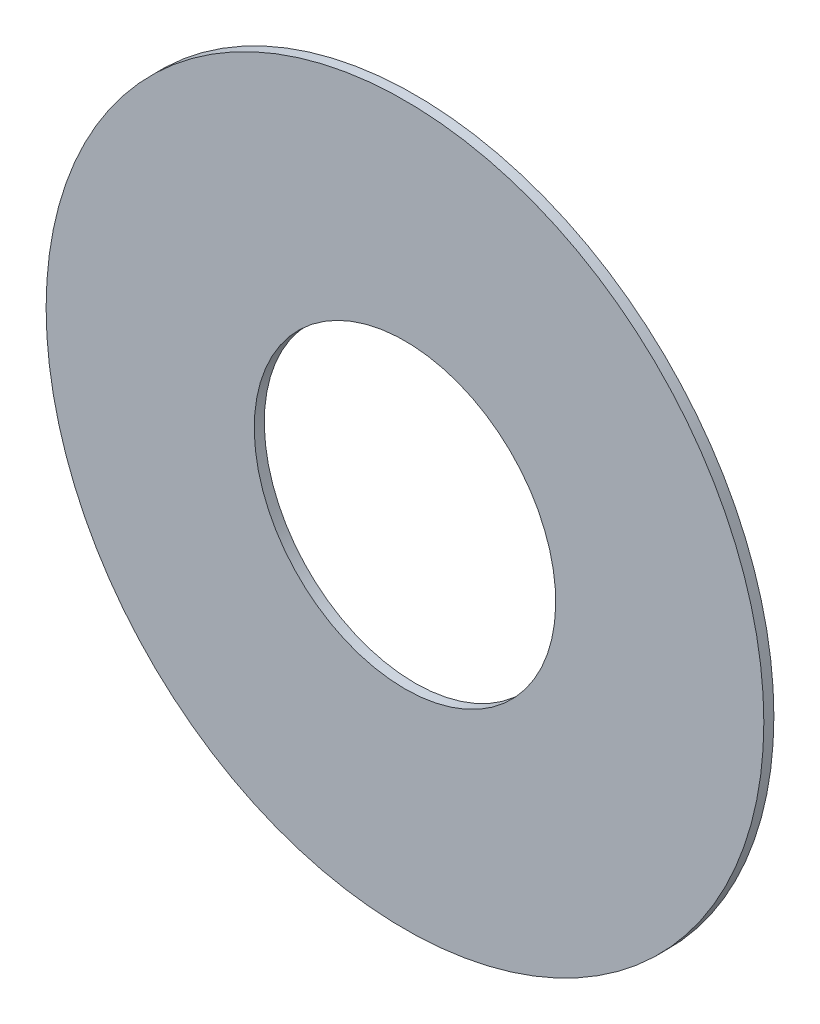
ISO-10303-21;
HEADER;
FILE_DESCRIPTION(('STEP AP214'),'2;1');
FILE_NAME('part.step','',(''),(''),'','','');
FILE_SCHEMA(('AUTOMOTIVE_DESIGN { 1 0 10303 214 1 1 1 1 }'));
ENDSEC;
DATA;
#1=APPLICATION_CONTEXT('core data for automotive mechanical design processes');
#2=APPLICATION_PROTOCOL_DEFINITION('international standard','automotive_design',2000,#1);
#3=PRODUCT_CONTEXT('',#1,'mechanical');
#4=PRODUCT('Part','Part','',(#3));
#5=PRODUCT_RELATED_PRODUCT_CATEGORY('part','',(#4));
#6=PRODUCT_DEFINITION_FORMATION('','',#4);
#7=PRODUCT_DEFINITION_CONTEXT('part definition',#1,'design');
#8=PRODUCT_DEFINITION('design','',#6,#7);
#9=PRODUCT_DEFINITION_SHAPE('','',#8);
#10=(LENGTH_UNIT() NAMED_UNIT(*) SI_UNIT(.MILLI.,.METRE.));
#11=(NAMED_UNIT(*) PLANE_ANGLE_UNIT() SI_UNIT($,.RADIAN.));
#12=(NAMED_UNIT(*) SI_UNIT($,.STERADIAN.) SOLID_ANGLE_UNIT());
#13=UNCERTAINTY_MEASURE_WITH_UNIT(LENGTH_MEASURE(1.E-05),#10,'distance_accuracy_value','');
#14=(GEOMETRIC_REPRESENTATION_CONTEXT(3) GLOBAL_UNCERTAINTY_ASSIGNED_CONTEXT((#13)) GLOBAL_UNIT_ASSIGNED_CONTEXT((#10,
#11,#12)) REPRESENTATION_CONTEXT('',''));
#15=CARTESIAN_POINT('',(0.,0.,0.));
#16=DIRECTION('',(0.,0.,1.));
#17=DIRECTION('',(1.,0.,0.));
#18=AXIS2_PLACEMENT_3D('',#15,#16,#17);
#19=CARTESIAN_POINT('',(123.952,-121.234,-0.045));
#20=DIRECTION('',(0.,0.,-1.));
#21=DIRECTION('',(0.,-1.,0.));
#22=AXIS2_PLACEMENT_3D('',#19,#20,#21);
#23=CYLINDRICAL_SURFACE('',#22,0.525);
#24=CARTESIAN_POINT('',(123.952,-121.234,1.67));
#25=DIRECTION('',(0.,0.,-1.));
#26=DIRECTION('',(0.,-1.,0.));
#27=AXIS2_PLACEMENT_3D('',#24,#25,#26);
#28=CIRCLE('',#27,0.525);
#29=CARTESIAN_POINT('',(123.952,-121.759,1.67));
#30=VERTEX_POINT('',#29);
#31=EDGE_CURVE('E20',#30,#30,#28,.T.);
#32=ORIENTED_EDGE('',*,*,#31,.T.);
#33=DIRECTION('',(0.,0.,1.));
#34=VECTOR('',#33,1.);
#35=CARTESIAN_POINT('',(123.952,-121.759,-0.045));
#36=LINE('',#35,#34);
#37=CARTESIAN_POINT('',(123.952,-121.759,1.705));
#38=VERTEX_POINT('',#37);
#39=EDGE_CURVE('E11',#30,#38,#36,.T.);
#40=ORIENTED_EDGE('',*,*,#39,.T.);
#41=CARTESIAN_POINT('',(123.952,-121.234,1.705));
#42=DIRECTION('',(0.,0.,-1.));
#43=DIRECTION('',(0.,-1.,0.));
#44=AXIS2_PLACEMENT_3D('',#41,#42,#43);
#45=CIRCLE('',#44,0.525);
#46=EDGE_CURVE('E69',#38,#38,#45,.T.);
#47=ORIENTED_EDGE('',*,*,#46,.F.);
#48=ORIENTED_EDGE('',*,*,#39,.F.);
#49=EDGE_LOOP('',(#32,#40,#47,#48));
#50=FACE_BOUND('',#49,.T.);
#51=ADVANCED_FACE('F17',(#50),#23,.F.);
#52=CARTESIAN_POINT('',(123.952,-121.234,1.67));
#53=DIRECTION('',(0.,0.,1.));
#54=DIRECTION('',(1.,0.,0.));
#55=AXIS2_PLACEMENT_3D('',#52,#53,#54);
#56=PLANE('',#55);
#57=ORIENTED_EDGE('',*,*,#31,.F.);
#58=EDGE_LOOP('',(#57));
#59=FACE_BOUND('',#58,.T.);
#60=CARTESIAN_POINT('',(123.952,-121.234,1.67));
#61=DIRECTION('',(0.,0.,1.));
#62=DIRECTION('',(1.,0.,0.));
#63=AXIS2_PLACEMENT_3D('',#60,#61,#62);
#64=CIRCLE('',#63,1.25);
#65=CARTESIAN_POINT('',(125.202,-121.234,1.67));
#66=VERTEX_POINT('',#65);
#67=EDGE_CURVE('E57',#66,#66,#64,.T.);
#68=ORIENTED_EDGE('',*,*,#67,.F.);
#69=EDGE_LOOP('',(#68));
#70=FACE_BOUND('',#69,.T.);
#71=ADVANCED_FACE('F79',(#59,#70),#56,.F.);
#72=CARTESIAN_POINT('',(123.952,-121.234,1.705));
#73=DIRECTION('',(0.,0.,1.));
#74=DIRECTION('',(1.,0.,0.));
#75=AXIS2_PLACEMENT_3D('',#72,#73,#74);
#76=PLANE('',#75);
#77=ORIENTED_EDGE('',*,*,#46,.T.);
#78=EDGE_LOOP('',(#77));
#79=FACE_BOUND('',#78,.T.);
#80=CARTESIAN_POINT('',(123.952,-121.234,1.705));
#81=DIRECTION('',(0.,0.,1.));
#82=DIRECTION('',(1.,0.,0.));
#83=AXIS2_PLACEMENT_3D('',#80,#81,#82);
#84=CIRCLE('',#83,1.25);
#85=CARTESIAN_POINT('',(125.202,-121.234,1.705));
#86=VERTEX_POINT('',#85);
#87=EDGE_CURVE('E55',#86,#86,#84,.T.);
#88=ORIENTED_EDGE('',*,*,#87,.T.);
#89=EDGE_LOOP('',(#88));
#90=FACE_BOUND('',#89,.T.);
#91=ADVANCED_FACE('F61',(#79,#90),#76,.T.);
#92=CARTESIAN_POINT('',(123.952,-121.234,1.67));
#93=DIRECTION('',(0.,0.,1.));
#94=DIRECTION('',(1.,0.,0.));
#95=AXIS2_PLACEMENT_3D('',#92,#93,#94);
#96=CYLINDRICAL_SURFACE('',#95,1.25);
#97=ORIENTED_EDGE('',*,*,#87,.F.);
#98=DIRECTION('',(0.,0.,1.));
#99=VECTOR('',#98,1.);
#100=CARTESIAN_POINT('',(125.202,-121.234,1.67));
#101=LINE('',#100,#99);
#102=EDGE_CURVE('E52',#66,#86,#101,.T.);
#103=ORIENTED_EDGE('',*,*,#102,.F.);
#104=ORIENTED_EDGE('',*,*,#67,.T.);
#105=ORIENTED_EDGE('',*,*,#102,.T.);
#106=EDGE_LOOP('',(#97,#103,#104,#105));
#107=FACE_BOUND('',#106,.T.);
#108=ADVANCED_FACE('F54',(#107),#96,.T.);
#109=CLOSED_SHELL('',(#51,#71,#91,#108));
#110=MANIFOLD_SOLID_BREP('B1',#109);
#111=ADVANCED_BREP_SHAPE_REPRESENTATION('',(#18,#110),#14);
#112=SHAPE_DEFINITION_REPRESENTATION(#9,#111);
ENDSEC;
END-ISO-10303-21;
